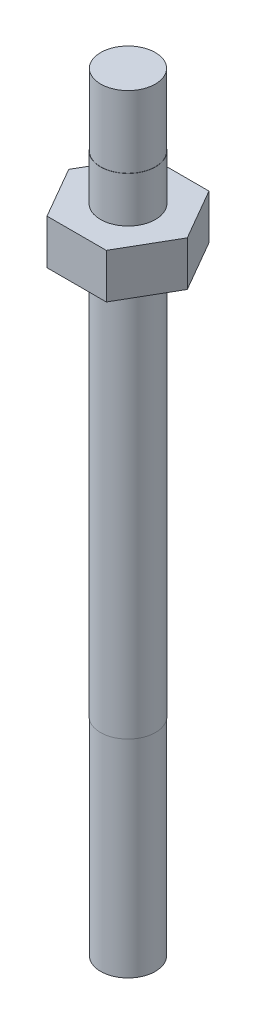
ISO-10303-21;
HEADER;
FILE_DESCRIPTION(('STEP AP214'),'2;1');
FILE_NAME('part.step','',(''),(''),'','','');
FILE_SCHEMA(('AUTOMOTIVE_DESIGN { 1 0 10303 214 1 1 1 1 }'));
ENDSEC;
DATA;
#1=APPLICATION_CONTEXT('core data for automotive mechanical design processes');
#2=APPLICATION_PROTOCOL_DEFINITION('international standard','automotive_design',2000,#1);
#3=PRODUCT_CONTEXT('',#1,'mechanical');
#4=PRODUCT('Part','Part','',(#3));
#5=PRODUCT_RELATED_PRODUCT_CATEGORY('part','',(#4));
#6=PRODUCT_DEFINITION_FORMATION('','',#4);
#7=PRODUCT_DEFINITION_CONTEXT('part definition',#1,'design');
#8=PRODUCT_DEFINITION('design','',#6,#7);
#9=PRODUCT_DEFINITION_SHAPE('','',#8);
#10=(LENGTH_UNIT() NAMED_UNIT(*) SI_UNIT(.MILLI.,.METRE.));
#11=(NAMED_UNIT(*) PLANE_ANGLE_UNIT() SI_UNIT($,.RADIAN.));
#12=(NAMED_UNIT(*) SI_UNIT($,.STERADIAN.) SOLID_ANGLE_UNIT());
#13=UNCERTAINTY_MEASURE_WITH_UNIT(LENGTH_MEASURE(1.E-05),#10,'distance_accuracy_value','');
#14=(GEOMETRIC_REPRESENTATION_CONTEXT(3) GLOBAL_UNCERTAINTY_ASSIGNED_CONTEXT((#13)) GLOBAL_UNIT_ASSIGNED_CONTEXT((#10,
#11,#12)) REPRESENTATION_CONTEXT('',''));
#15=CARTESIAN_POINT('',(0.,0.,0.));
#16=DIRECTION('',(0.,0.,1.));
#17=DIRECTION('',(1.,0.,0.));
#18=AXIS2_PLACEMENT_3D('',#15,#16,#17);
#19=CARTESIAN_POINT('',(0.,0.,0.));
#20=DIRECTION('',(0.,-1.,0.));
#21=DIRECTION('',(0.,0.,-1.));
#22=AXIS2_PLACEMENT_3D('',#19,#20,#21);
#23=CYLINDRICAL_SURFACE('',#22,1.6764);
#24=CARTESIAN_POINT('',(0.,12.7,0.));
#25=DIRECTION('',(0.,-1.,0.));
#26=DIRECTION('',(0.,0.,-1.));
#27=AXIS2_PLACEMENT_3D('',#24,#25,#26);
#28=CIRCLE('',#27,1.6764);
#29=CARTESIAN_POINT('',(0.,12.7,-1.6764));
#30=VERTEX_POINT('',#29);
#31=EDGE_CURVE('E136',#30,#30,#28,.T.);
#32=ORIENTED_EDGE('',*,*,#31,.T.);
#33=EDGE_LOOP('',(#32));
#34=FACE_BOUND('',#33,.T.);
#35=CARTESIAN_POINT('',(0.,0.,0.));
#36=DIRECTION('',(0.,-1.,0.));
#37=DIRECTION('',(0.,0.,-1.));
#38=AXIS2_PLACEMENT_3D('',#35,#36,#37);
#39=CIRCLE('',#38,1.6764);
#40=CARTESIAN_POINT('',(0.,0.,-1.6764));
#41=VERTEX_POINT('',#40);
#42=EDGE_CURVE('E11',#41,#41,#39,.T.);
#43=ORIENTED_EDGE('',*,*,#42,.F.);
#44=EDGE_LOOP('',(#43));
#45=FACE_BOUND('',#44,.T.);
#46=ADVANCED_FACE('F35',(#34,#45),#23,.T.);
#47=CARTESIAN_POINT('',(0.,0.,0.));
#48=DIRECTION('',(0.,-1.,0.));
#49=DIRECTION('',(0.,0.,-1.));
#50=AXIS2_PLACEMENT_3D('',#47,#48,#49);
#51=PLANE('',#50);
#52=ORIENTED_EDGE('',*,*,#42,.T.);
#53=EDGE_LOOP('',(#52));
#54=FACE_BOUND('',#53,.T.);
#55=ADVANCED_FACE('F172',(#54),#51,.T.);
#56=CARTESIAN_POINT('',(1.6891,37.211,0.));
#57=DIRECTION('',(0.,-1.,0.));
#58=DIRECTION('',(0.,0.,-1.));
#59=AXIS2_PLACEMENT_3D('',#56,#57,#58);
#60=PLANE('',#59);
#61=CARTESIAN_POINT('',(0.,37.211,0.));
#62=DIRECTION('',(0.,-1.,0.));
#63=DIRECTION('',(0.,0.,-1.));
#64=AXIS2_PLACEMENT_3D('',#61,#62,#63);
#65=CIRCLE('',#64,1.6891);
#66=CARTESIAN_POINT('',(0.,37.211,-1.6891));
#67=VERTEX_POINT('',#66);
#68=EDGE_CURVE('E142',#67,#67,#65,.T.);
#69=ORIENTED_EDGE('',*,*,#68,.F.);
#70=EDGE_LOOP('',(#69));
#71=FACE_BOUND('',#70,.T.);
#72=DIRECTION('',(0.5,0.,-0.866025403784439));
#73=VECTOR('',#72,1.);
#74=CARTESIAN_POINT('',(1.81842240783965,37.211,3.1496));
#75=LINE('',#74,#73);
#76=CARTESIAN_POINT('',(1.81842240783965,37.211,3.1496));
#77=VERTEX_POINT('',#76);
#78=CARTESIAN_POINT('',(3.63684481567929,37.211,0.));
#79=VERTEX_POINT('',#78);
#80=EDGE_CURVE('E118',#77,#79,#75,.T.);
#81=ORIENTED_EDGE('',*,*,#80,.F.);
#82=DIRECTION('',(1.,0.,0.));
#83=VECTOR('',#82,1.);
#84=CARTESIAN_POINT('',(-1.81842240783965,37.211,3.1496));
#85=LINE('',#84,#83);
#86=CARTESIAN_POINT('',(-1.81842240783964,37.211,3.1496));
#87=VERTEX_POINT('',#86);
#88=EDGE_CURVE('E121',#87,#77,#85,.T.);
#89=ORIENTED_EDGE('',*,*,#88,.F.);
#90=DIRECTION('',(0.5,0.,0.866025403784439));
#91=VECTOR('',#90,1.);
#92=CARTESIAN_POINT('',(-3.63684481567929,37.211,0.));
#93=LINE('',#92,#91);
#94=CARTESIAN_POINT('',(-3.63684481567929,37.211,0.));
#95=VERTEX_POINT('',#94);
#96=EDGE_CURVE('E125',#95,#87,#93,.T.);
#97=ORIENTED_EDGE('',*,*,#96,.F.);
#98=DIRECTION('',(-0.5,0.,0.866025403784439));
#99=VECTOR('',#98,1.);
#100=CARTESIAN_POINT('',(-1.81842240783965,37.211,-3.1496));
#101=LINE('',#100,#99);
#102=CARTESIAN_POINT('',(-1.81842240783965,37.211,-3.1496));
#103=VERTEX_POINT('',#102);
#104=EDGE_CURVE('E74',#103,#95,#101,.T.);
#105=ORIENTED_EDGE('',*,*,#104,.F.);
#106=DIRECTION('',(-1.,0.,0.));
#107=VECTOR('',#106,1.);
#108=CARTESIAN_POINT('',(1.81842240783965,37.211,-3.1496));
#109=LINE('',#108,#107);
#110=CARTESIAN_POINT('',(1.81842240783965,37.211,-3.1496));
#111=VERTEX_POINT('',#110);
#112=EDGE_CURVE('E79',#111,#103,#109,.T.);
#113=ORIENTED_EDGE('',*,*,#112,.F.);
#114=DIRECTION('',(-0.5,0.,-0.866025403784439));
#115=VECTOR('',#114,1.);
#116=CARTESIAN_POINT('',(3.63684481567929,37.211,0.));
#117=LINE('',#116,#115);
#118=EDGE_CURVE('E100',#79,#111,#117,.T.);
#119=ORIENTED_EDGE('',*,*,#118,.F.);
#120=EDGE_LOOP('',(#81,#89,#97,#105,#113,#119));
#121=FACE_BOUND('',#120,.T.);
#122=ADVANCED_FACE('F177',(#71,#121),#60,.T.);
#123=CARTESIAN_POINT('',(0.,0.,0.));
#124=DIRECTION('',(0.,-1.,0.));
#125=DIRECTION('',(0.,0.,-1.));
#126=AXIS2_PLACEMENT_3D('',#123,#124,#125);
#127=CYLINDRICAL_SURFACE('',#126,1.6891);
#128=ORIENTED_EDGE('',*,*,#68,.T.);
#129=EDGE_LOOP('',(#128));
#130=FACE_BOUND('',#129,.T.);
#131=CARTESIAN_POINT('',(0.,12.7,0.));
#132=DIRECTION('',(0.,-1.,0.));
#133=DIRECTION('',(0.,0.,-1.));
#134=AXIS2_PLACEMENT_3D('',#131,#132,#133);
#135=CIRCLE('',#134,1.6891);
#136=CARTESIAN_POINT('',(0.,12.7,-1.6891));
#137=VERTEX_POINT('',#136);
#138=EDGE_CURVE('E139',#137,#137,#135,.T.);
#139=ORIENTED_EDGE('',*,*,#138,.F.);
#140=EDGE_LOOP('',(#139));
#141=FACE_BOUND('',#140,.T.);
#142=ADVANCED_FACE('F185',(#130,#141),#127,.T.);
#143=CARTESIAN_POINT('',(1.6764,12.7,0.));
#144=DIRECTION('',(0.,-1.,0.));
#145=DIRECTION('',(0.,0.,-1.));
#146=AXIS2_PLACEMENT_3D('',#143,#144,#145);
#147=PLANE('',#146);
#148=ORIENTED_EDGE('',*,*,#138,.T.);
#149=EDGE_LOOP('',(#148));
#150=FACE_BOUND('',#149,.T.);
#151=ORIENTED_EDGE('',*,*,#31,.F.);
#152=EDGE_LOOP('',(#151));
#153=FACE_BOUND('',#152,.T.);
#154=ADVANCED_FACE('F183',(#150,#153),#147,.T.);
#155=CARTESIAN_POINT('',(3.63684481567929,27.5888130607781,0.));
#156=DIRECTION('',(0.866025403784438,0.,-0.5));
#157=DIRECTION('',(-0.5,0.,-0.866025403784439));
#158=AXIS2_PLACEMENT_3D('',#155,#156,#157);
#159=PLANE('',#158);
#160=DIRECTION('',(0.,1.,0.));
#161=VECTOR('',#160,1.);
#162=CARTESIAN_POINT('',(3.63684481567929,27.5888130607781,0.));
#163=LINE('',#162,#161);
#164=CARTESIAN_POINT('',(3.63684481567929,39.9542,0.));
#165=VERTEX_POINT('',#164);
#166=EDGE_CURVE('E51',#79,#165,#163,.T.);
#167=ORIENTED_EDGE('',*,*,#166,.F.);
#168=ORIENTED_EDGE('',*,*,#118,.T.);
#169=DIRECTION('',(0.,1.,0.));
#170=VECTOR('',#169,1.);
#171=CARTESIAN_POINT('',(1.81842240783965,27.5888130607781,-3.1496));
#172=LINE('',#171,#170);
#173=CARTESIAN_POINT('',(1.81842240783965,39.9542,-3.1496));
#174=VERTEX_POINT('',#173);
#175=EDGE_CURVE('E95',#111,#174,#172,.T.);
#176=ORIENTED_EDGE('',*,*,#175,.T.);
#177=DIRECTION('',(-0.5,0.,-0.866025403784439));
#178=VECTOR('',#177,1.);
#179=CARTESIAN_POINT('',(3.63684481567929,39.9542,0.));
#180=LINE('',#179,#178);
#181=EDGE_CURVE('E98',#165,#174,#180,.T.);
#182=ORIENTED_EDGE('',*,*,#181,.F.);
#183=EDGE_LOOP('',(#167,#168,#176,#182));
#184=FACE_BOUND('',#183,.T.);
#185=ADVANCED_FACE('F96',(#184),#159,.T.);
#186=CARTESIAN_POINT('',(1.81842240783965,27.5888130607781,-3.1496));
#187=DIRECTION('',(0.,0.,-1.));
#188=DIRECTION('',(-1.,0.,0.));
#189=AXIS2_PLACEMENT_3D('',#186,#187,#188);
#190=PLANE('',#189);
#191=ORIENTED_EDGE('',*,*,#175,.F.);
#192=ORIENTED_EDGE('',*,*,#112,.T.);
#193=DIRECTION('',(0.,1.,0.));
#194=VECTOR('',#193,1.);
#195=CARTESIAN_POINT('',(-1.81842240783965,27.5888130607781,-3.1496));
#196=LINE('',#195,#194);
#197=CARTESIAN_POINT('',(-1.81842240783965,39.9542,-3.1496));
#198=VERTEX_POINT('',#197);
#199=EDGE_CURVE('E90',#103,#198,#196,.T.);
#200=ORIENTED_EDGE('',*,*,#199,.T.);
#201=DIRECTION('',(-1.,0.,0.));
#202=VECTOR('',#201,1.);
#203=CARTESIAN_POINT('',(1.81842240783965,39.9542,-3.1496));
#204=LINE('',#203,#202);
#205=EDGE_CURVE('E103',#174,#198,#204,.T.);
#206=ORIENTED_EDGE('',*,*,#205,.F.);
#207=EDGE_LOOP('',(#191,#192,#200,#206));
#208=FACE_BOUND('',#207,.T.);
#209=ADVANCED_FACE('F104',(#208),#190,.T.);
#210=CARTESIAN_POINT('',(-1.81842240783965,27.5888130607781,-3.1496));
#211=DIRECTION('',(-0.866025403784438,0.,-0.5));
#212=DIRECTION('',(-0.5,0.,0.866025403784439));
#213=AXIS2_PLACEMENT_3D('',#210,#211,#212);
#214=PLANE('',#213);
#215=ORIENTED_EDGE('',*,*,#199,.F.);
#216=ORIENTED_EDGE('',*,*,#104,.T.);
#217=DIRECTION('',(0.,1.,0.));
#218=VECTOR('',#217,1.);
#219=CARTESIAN_POINT('',(-3.63684481567929,27.5888130607781,0.));
#220=LINE('',#219,#218);
#221=CARTESIAN_POINT('',(-3.63684481567929,39.9542,0.));
#222=VERTEX_POINT('',#221);
#223=EDGE_CURVE('E128',#95,#222,#220,.T.);
#224=ORIENTED_EDGE('',*,*,#223,.T.);
#225=DIRECTION('',(-0.5,0.,0.866025403784439));
#226=VECTOR('',#225,1.);
#227=CARTESIAN_POINT('',(-1.81842240783965,39.9542,-3.1496));
#228=LINE('',#227,#226);
#229=EDGE_CURVE('E107',#198,#222,#228,.T.);
#230=ORIENTED_EDGE('',*,*,#229,.F.);
#231=EDGE_LOOP('',(#215,#216,#224,#230));
#232=FACE_BOUND('',#231,.T.);
#233=ADVANCED_FACE('F253',(#232),#214,.T.);
#234=CARTESIAN_POINT('',(-3.63684481567929,27.5888130607781,0.));
#235=DIRECTION('',(-0.866025403784438,0.,0.5));
#236=DIRECTION('',(0.5,0.,0.866025403784439));
#237=AXIS2_PLACEMENT_3D('',#234,#235,#236);
#238=PLANE('',#237);
#239=ORIENTED_EDGE('',*,*,#223,.F.);
#240=ORIENTED_EDGE('',*,*,#96,.T.);
#241=DIRECTION('',(0.,1.,0.));
#242=VECTOR('',#241,1.);
#243=CARTESIAN_POINT('',(-1.81842240783965,27.5888130607781,3.1496));
#244=LINE('',#243,#242);
#245=CARTESIAN_POINT('',(-1.81842240783965,39.9542,3.1496));
#246=VERTEX_POINT('',#245);
#247=EDGE_CURVE('E124',#87,#246,#244,.T.);
#248=ORIENTED_EDGE('',*,*,#247,.T.);
#249=DIRECTION('',(0.5,0.,0.866025403784439));
#250=VECTOR('',#249,1.);
#251=CARTESIAN_POINT('',(-3.63684481567929,39.9542,0.));
#252=LINE('',#251,#250);
#253=EDGE_CURVE('E325',#222,#246,#252,.T.);
#254=ORIENTED_EDGE('',*,*,#253,.F.);
#255=EDGE_LOOP('',(#239,#240,#248,#254));
#256=FACE_BOUND('',#255,.T.);
#257=ADVANCED_FACE('F243',(#256),#238,.T.);
#258=CARTESIAN_POINT('',(-1.81842240783965,27.5888130607781,3.1496));
#259=DIRECTION('',(0.,0.,1.));
#260=DIRECTION('',(1.,0.,0.));
#261=AXIS2_PLACEMENT_3D('',#258,#259,#260);
#262=PLANE('',#261);
#263=ORIENTED_EDGE('',*,*,#247,.F.);
#264=ORIENTED_EDGE('',*,*,#88,.T.);
#265=DIRECTION('',(0.,1.,0.));
#266=VECTOR('',#265,1.);
#267=CARTESIAN_POINT('',(1.81842240783965,27.5888130607781,3.1496));
#268=LINE('',#267,#266);
#269=CARTESIAN_POINT('',(1.81842240783965,39.9542,3.1496));
#270=VERTEX_POINT('',#269);
#271=EDGE_CURVE('E120',#77,#270,#268,.T.);
#272=ORIENTED_EDGE('',*,*,#271,.T.);
#273=DIRECTION('',(1.,0.,0.));
#274=VECTOR('',#273,1.);
#275=CARTESIAN_POINT('',(-1.81842240783965,39.9542,3.1496));
#276=LINE('',#275,#274);
#277=EDGE_CURVE('E117',#246,#270,#276,.T.);
#278=ORIENTED_EDGE('',*,*,#277,.F.);
#279=EDGE_LOOP('',(#263,#264,#272,#278));
#280=FACE_BOUND('',#279,.T.);
#281=ADVANCED_FACE('F169',(#280),#262,.T.);
#282=CARTESIAN_POINT('',(1.81842240783965,27.5888130607781,3.1496));
#283=DIRECTION('',(0.866025403784438,0.,0.5));
#284=DIRECTION('',(0.5,0.,-0.866025403784439));
#285=AXIS2_PLACEMENT_3D('',#282,#283,#284);
#286=PLANE('',#285);
#287=ORIENTED_EDGE('',*,*,#271,.F.);
#288=ORIENTED_EDGE('',*,*,#80,.T.);
#289=ORIENTED_EDGE('',*,*,#166,.T.);
#290=DIRECTION('',(0.5,0.,-0.866025403784439));
#291=VECTOR('',#290,1.);
#292=CARTESIAN_POINT('',(1.81842240783965,39.9542,3.1496));
#293=LINE('',#292,#291);
#294=EDGE_CURVE('E111',#270,#165,#293,.T.);
#295=ORIENTED_EDGE('',*,*,#294,.F.);
#296=EDGE_LOOP('',(#287,#288,#289,#295));
#297=FACE_BOUND('',#296,.T.);
#298=ADVANCED_FACE('F161',(#297),#286,.T.);
#299=CARTESIAN_POINT('',(1.6764,47.1424,0.));
#300=DIRECTION('',(0.,1.,0.));
#301=DIRECTION('',(0.,0.,1.));
#302=AXIS2_PLACEMENT_3D('',#299,#300,#301);
#303=PLANE('',#302);
#304=CARTESIAN_POINT('',(0.,47.1424,0.));
#305=DIRECTION('',(0.,-1.,0.));
#306=DIRECTION('',(0.,0.,-1.));
#307=AXIS2_PLACEMENT_3D('',#304,#305,#306);
#308=CIRCLE('',#307,1.6764);
#309=CARTESIAN_POINT('',(0.,47.1424,-1.6764));
#310=VERTEX_POINT('',#309);
#311=EDGE_CURVE('E43',#310,#310,#308,.T.);
#312=ORIENTED_EDGE('',*,*,#311,.F.);
#313=EDGE_LOOP('',(#312));
#314=FACE_BOUND('',#313,.T.);
#315=ADVANCED_FACE('F159',(#314),#303,.T.);
#316=CARTESIAN_POINT('',(0.,0.,0.));
#317=DIRECTION('',(0.,-1.,0.));
#318=DIRECTION('',(0.,0.,-1.));
#319=AXIS2_PLACEMENT_3D('',#316,#317,#318);
#320=CYLINDRICAL_SURFACE('',#319,1.6764);
#321=ORIENTED_EDGE('',*,*,#311,.T.);
#322=EDGE_LOOP('',(#321));
#323=FACE_BOUND('',#322,.T.);
#324=CARTESIAN_POINT('',(0.,42.7482,0.));
#325=DIRECTION('',(0.,-1.,0.));
#326=DIRECTION('',(0.,0.,-1.));
#327=AXIS2_PLACEMENT_3D('',#324,#325,#326);
#328=CIRCLE('',#327,1.6764);
#329=CARTESIAN_POINT('',(0.,42.7482,-1.6764));
#330=VERTEX_POINT('',#329);
#331=EDGE_CURVE('E151',#330,#330,#328,.T.);
#332=ORIENTED_EDGE('',*,*,#331,.F.);
#333=EDGE_LOOP('',(#332));
#334=FACE_BOUND('',#333,.T.);
#335=ADVANCED_FACE('F156',(#323,#334),#320,.T.);
#336=CARTESIAN_POINT('',(1.6891,42.7482,0.));
#337=DIRECTION('',(0.,1.,0.));
#338=DIRECTION('',(0.,0.,1.));
#339=AXIS2_PLACEMENT_3D('',#336,#337,#338);
#340=PLANE('',#339);
#341=ORIENTED_EDGE('',*,*,#331,.T.);
#342=EDGE_LOOP('',(#341));
#343=FACE_BOUND('',#342,.T.);
#344=CARTESIAN_POINT('',(0.,42.7482,0.));
#345=DIRECTION('',(0.,-1.,0.));
#346=DIRECTION('',(0.,0.,-1.));
#347=AXIS2_PLACEMENT_3D('',#344,#345,#346);
#348=CIRCLE('',#347,1.6891);
#349=CARTESIAN_POINT('',(0.,42.7482,-1.6891));
#350=VERTEX_POINT('',#349);
#351=EDGE_CURVE('E148',#350,#350,#348,.T.);
#352=ORIENTED_EDGE('',*,*,#351,.F.);
#353=EDGE_LOOP('',(#352));
#354=FACE_BOUND('',#353,.T.);
#355=ADVANCED_FACE('F167',(#343,#354),#340,.T.);
#356=CARTESIAN_POINT('',(0.,0.,0.));
#357=DIRECTION('',(0.,-1.,0.));
#358=DIRECTION('',(0.,0.,-1.));
#359=AXIS2_PLACEMENT_3D('',#356,#357,#358);
#360=CYLINDRICAL_SURFACE('',#359,1.6891);
#361=ORIENTED_EDGE('',*,*,#351,.T.);
#362=EDGE_LOOP('',(#361));
#363=FACE_BOUND('',#362,.T.);
#364=CARTESIAN_POINT('',(0.,39.9542,0.));
#365=DIRECTION('',(0.,-1.,0.));
#366=DIRECTION('',(0.,0.,-1.));
#367=AXIS2_PLACEMENT_3D('',#364,#365,#366);
#368=CIRCLE('',#367,1.6891);
#369=CARTESIAN_POINT('',(0.,39.9542,-1.6891));
#370=VERTEX_POINT('',#369);
#371=EDGE_CURVE('E145',#370,#370,#368,.T.);
#372=ORIENTED_EDGE('',*,*,#371,.F.);
#373=EDGE_LOOP('',(#372));
#374=FACE_BOUND('',#373,.T.);
#375=ADVANCED_FACE('F202',(#363,#374),#360,.T.);
#376=CARTESIAN_POINT('',(3.1115,39.9542,0.));
#377=DIRECTION('',(0.,1.,0.));
#378=DIRECTION('',(0.,0.,1.));
#379=AXIS2_PLACEMENT_3D('',#376,#377,#378);
#380=PLANE('',#379);
#381=ORIENTED_EDGE('',*,*,#371,.T.);
#382=EDGE_LOOP('',(#381));
#383=FACE_BOUND('',#382,.T.);
#384=ORIENTED_EDGE('',*,*,#294,.T.);
#385=ORIENTED_EDGE('',*,*,#181,.T.);
#386=ORIENTED_EDGE('',*,*,#205,.T.);
#387=ORIENTED_EDGE('',*,*,#229,.T.);
#388=ORIENTED_EDGE('',*,*,#253,.T.);
#389=ORIENTED_EDGE('',*,*,#277,.T.);
#390=EDGE_LOOP('',(#384,#385,#386,#387,#388,#389));
#391=FACE_BOUND('',#390,.T.);
#392=ADVANCED_FACE('F109',(#383,#391),#380,.T.);
#393=CLOSED_SHELL('',(#46,#55,#122,#142,#154,#185,#209,#233,#257,#281,#298,#315,#335,#355,#375,#392));
#394=MANIFOLD_SOLID_BREP('B2',#393);
#395=ADVANCED_BREP_SHAPE_REPRESENTATION('',(#18,#394),#14);
#396=SHAPE_DEFINITION_REPRESENTATION(#9,#395);
ENDSEC;
END-ISO-10303-21;
